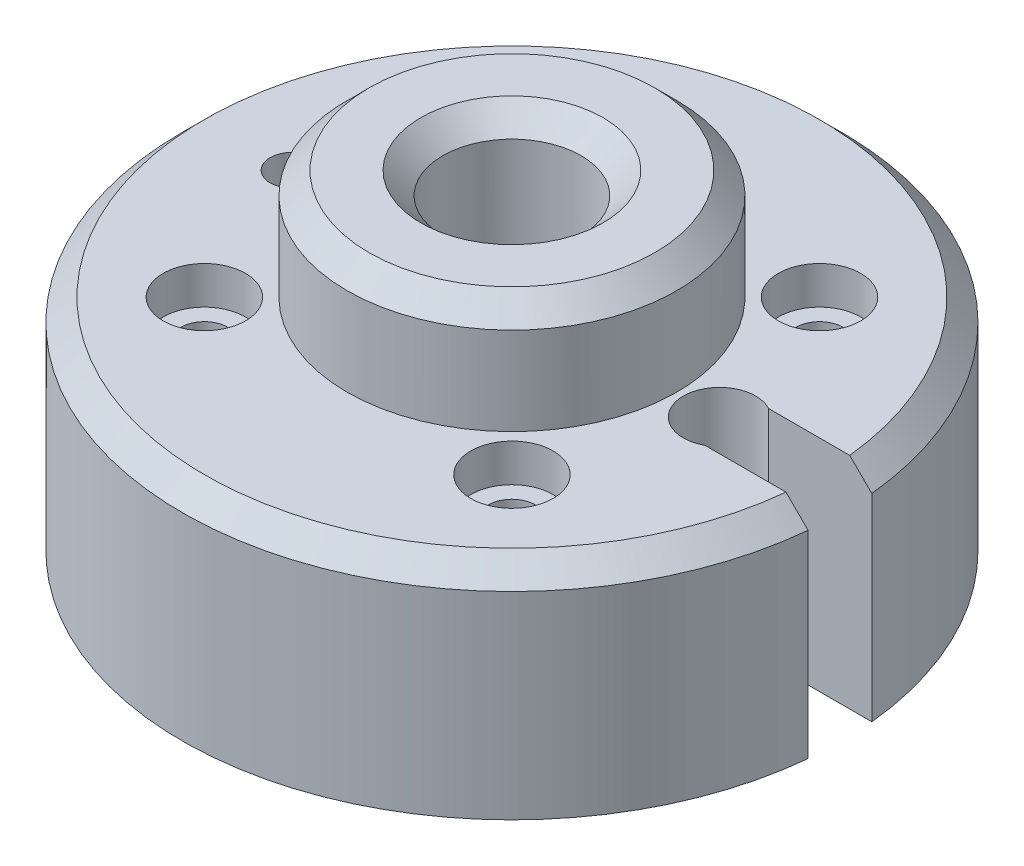
ISO-10303-21;
HEADER;
FILE_DESCRIPTION(('STEP AP214'),'2;1');
FILE_NAME('part.step','',(''),(''),'','','');
FILE_SCHEMA(('AUTOMOTIVE_DESIGN { 1 0 10303 214 1 1 1 1 }'));
ENDSEC;
DATA;
#1=APPLICATION_CONTEXT('core data for automotive mechanical design processes');
#2=APPLICATION_PROTOCOL_DEFINITION('international standard','automotive_design',2000,#1);
#3=PRODUCT_CONTEXT('',#1,'mechanical');
#4=PRODUCT('Part','Part','',(#3));
#5=PRODUCT_RELATED_PRODUCT_CATEGORY('part','',(#4));
#6=PRODUCT_DEFINITION_FORMATION('','',#4);
#7=PRODUCT_DEFINITION_CONTEXT('part definition',#1,'design');
#8=PRODUCT_DEFINITION('design','',#6,#7);
#9=PRODUCT_DEFINITION_SHAPE('','',#8);
#10=(LENGTH_UNIT() NAMED_UNIT(*) SI_UNIT(.MILLI.,.METRE.));
#11=(NAMED_UNIT(*) PLANE_ANGLE_UNIT() SI_UNIT($,.RADIAN.));
#12=(NAMED_UNIT(*) SI_UNIT($,.STERADIAN.) SOLID_ANGLE_UNIT());
#13=UNCERTAINTY_MEASURE_WITH_UNIT(LENGTH_MEASURE(1.E-05),#10,'distance_accuracy_value','');
#14=(GEOMETRIC_REPRESENTATION_CONTEXT(3) GLOBAL_UNCERTAINTY_ASSIGNED_CONTEXT((#13)) GLOBAL_UNIT_ASSIGNED_CONTEXT((#10,
#11,#12)) REPRESENTATION_CONTEXT('',''));
#15=CARTESIAN_POINT('',(0.,0.,0.));
#16=DIRECTION('',(0.,0.,1.));
#17=DIRECTION('',(1.,0.,0.));
#18=AXIS2_PLACEMENT_3D('',#15,#16,#17);
#19=CARTESIAN_POINT('',(9.525,12.7,0.));
#20=DIRECTION('',(0.,-1.,0.));
#21=DIRECTION('',(0.,0.,-1.));
#22=AXIS2_PLACEMENT_3D('',#19,#20,#21);
#23=PLANE('',#22);
#24=CARTESIAN_POINT('',(-12.7,12.7,0.));
#25=DIRECTION('',(0.,1.,0.));
#26=DIRECTION('',(0.,0.,1.));
#27=AXIS2_PLACEMENT_3D('',#24,#25,#26);
#28=CIRCLE('',#27,1.27);
#29=CARTESIAN_POINT('',(-12.7,12.7,1.27000000000001));
#30=VERTEX_POINT('',#29);
#31=EDGE_CURVE('E118',#30,#30,#28,.T.);
#32=ORIENTED_EDGE('',*,*,#31,.F.);
#33=EDGE_LOOP('',(#32));
#34=FACE_BOUND('',#33,.T.);
#35=CARTESIAN_POINT('',(12.,12.7,0.));
#36=DIRECTION('',(0.,1.,0.));
#37=DIRECTION('',(0.,0.,1.));
#38=AXIS2_PLACEMENT_3D('',#35,#36,#37);
#39=CIRCLE('',#38,2.0955);
#40=CARTESIAN_POINT('',(12.9999989999995,12.7,-1.8415));
#41=VERTEX_POINT('',#40);
#42=CARTESIAN_POINT('',(12.9999989999995,12.7,1.8415));
#43=VERTEX_POINT('',#42);
#44=EDGE_CURVE('E100',#41,#43,#39,.T.);
#45=ORIENTED_EDGE('',*,*,#44,.F.);
#46=DIRECTION('',(-1.,0.,0.));
#47=VECTOR('',#46,1.);
#48=CARTESIAN_POINT('',(12.9999989999995,12.7,-1.8415));
#49=LINE('',#48,#47);
#50=CARTESIAN_POINT('',(17.684379484449,12.7,-1.8415));
#51=VERTEX_POINT('',#50);
#52=EDGE_CURVE('E114',#51,#41,#49,.T.);
#53=ORIENTED_EDGE('',*,*,#52,.F.);
#54=CARTESIAN_POINT('',(0.,12.7,0.));
#55=DIRECTION('',(0.,-1.,0.));
#56=DIRECTION('',(0.,0.,-1.));
#57=AXIS2_PLACEMENT_3D('',#54,#55,#56);
#58=CIRCLE('',#57,17.78);
#59=CARTESIAN_POINT('',(17.684379484449,12.7,1.8415));
#60=VERTEX_POINT('',#59);
#61=EDGE_CURVE('E197',#51,#60,#58,.F.);
#62=ORIENTED_EDGE('',*,*,#61,.T.);
#63=DIRECTION('',(1.,0.,0.));
#64=VECTOR('',#63,1.);
#65=CARTESIAN_POINT('',(12.9999989999995,12.7,1.8415));
#66=LINE('',#65,#64);
#67=EDGE_CURVE('E61',#43,#60,#66,.T.);
#68=ORIENTED_EDGE('',*,*,#67,.F.);
#69=EDGE_LOOP('',(#45,#53,#62,#68));
#70=FACE_BOUND('',#69,.T.);
#71=CARTESIAN_POINT('',(0.,12.7,0.));
#72=DIRECTION('',(0.,1.,0.));
#73=DIRECTION('',(0.,0.,1.));
#74=AXIS2_PLACEMENT_3D('',#71,#72,#73);
#75=CIRCLE('',#74,9.525);
#76=CARTESIAN_POINT('',(0.,12.7,9.525));
#77=VERTEX_POINT('',#76);
#78=EDGE_CURVE('E182',#77,#77,#75,.T.);
#79=ORIENTED_EDGE('',*,*,#78,.F.);
#80=EDGE_LOOP('',(#79));
#81=FACE_BOUND('',#80,.T.);
#82=CARTESIAN_POINT('',(-8.89,12.7,-8.89));
#83=DIRECTION('',(0.,1.,0.));
#84=DIRECTION('',(0.,0.,1.));
#85=AXIS2_PLACEMENT_3D('',#82,#83,#84);
#86=CIRCLE('',#85,2.38125);
#87=CARTESIAN_POINT('',(-8.89,12.7,-6.50875));
#88=VERTEX_POINT('',#87);
#89=EDGE_CURVE('E165',#88,#88,#86,.T.);
#90=ORIENTED_EDGE('',*,*,#89,.F.);
#91=EDGE_LOOP('',(#90));
#92=FACE_BOUND('',#91,.T.);
#93=CARTESIAN_POINT('',(8.89,12.7,-8.89));
#94=DIRECTION('',(0.,1.,0.));
#95=DIRECTION('',(0.,0.,1.));
#96=AXIS2_PLACEMENT_3D('',#93,#94,#95);
#97=CIRCLE('',#96,2.38125);
#98=CARTESIAN_POINT('',(8.89,12.7,-6.50875));
#99=VERTEX_POINT('',#98);
#100=EDGE_CURVE('E153',#99,#99,#97,.T.);
#101=ORIENTED_EDGE('',*,*,#100,.F.);
#102=EDGE_LOOP('',(#101));
#103=FACE_BOUND('',#102,.T.);
#104=CARTESIAN_POINT('',(8.89,12.7,8.89));
#105=DIRECTION('',(0.,1.,0.));
#106=DIRECTION('',(0.,0.,1.));
#107=AXIS2_PLACEMENT_3D('',#104,#105,#106);
#108=CIRCLE('',#107,2.38125);
#109=CARTESIAN_POINT('',(8.89,12.7,11.27125));
#110=VERTEX_POINT('',#109);
#111=EDGE_CURVE('E141',#110,#110,#108,.T.);
#112=ORIENTED_EDGE('',*,*,#111,.F.);
#113=EDGE_LOOP('',(#112));
#114=FACE_BOUND('',#113,.T.);
#115=CARTESIAN_POINT('',(-8.89,12.7,8.89));
#116=DIRECTION('',(0.,1.,0.));
#117=DIRECTION('',(0.,0.,1.));
#118=AXIS2_PLACEMENT_3D('',#115,#116,#117);
#119=CIRCLE('',#118,2.38125);
#120=CARTESIAN_POINT('',(-8.89,12.7,11.27125));
#121=VERTEX_POINT('',#120);
#122=EDGE_CURVE('E127',#121,#121,#119,.T.);
#123=ORIENTED_EDGE('',*,*,#122,.F.);
#124=EDGE_LOOP('',(#123));
#125=FACE_BOUND('',#124,.T.);
#126=ADVANCED_FACE('F39',(#34,#70,#81,#92,#103,#114,#125),#23,.F.);
#127=CARTESIAN_POINT('',(0.,24.6002819548872,0.));
#128=DIRECTION('',(0.,1.,0.));
#129=DIRECTION('',(0.,0.,1.));
#130=AXIS2_PLACEMENT_3D('',#127,#128,#129);
#131=CYLINDRICAL_SURFACE('',#130,4.);
#132=CARTESIAN_POINT('',(0.,17.78,0.));
#133=DIRECTION('',(0.,-1.,0.));
#134=DIRECTION('',(0.,0.,-1.));
#135=AXIS2_PLACEMENT_3D('',#132,#133,#134);
#136=CIRCLE('',#135,4.);
#137=CARTESIAN_POINT('',(0.,17.78,-4.));
#138=VERTEX_POINT('',#137);
#139=EDGE_CURVE('E185',#138,#138,#136,.F.);
#140=ORIENTED_EDGE('',*,*,#139,.T.);
#141=EDGE_LOOP('',(#140));
#142=FACE_BOUND('',#141,.T.);
#143=CARTESIAN_POINT('',(0.,0.,0.));
#144=DIRECTION('',(0.,1.,0.));
#145=DIRECTION('',(0.,0.,1.));
#146=AXIS2_PLACEMENT_3D('',#143,#144,#145);
#147=CIRCLE('',#146,4.);
#148=CARTESIAN_POINT('',(0.,0.,4.));
#149=VERTEX_POINT('',#148);
#150=EDGE_CURVE('E177',#149,#149,#147,.T.);
#151=ORIENTED_EDGE('',*,*,#150,.F.);
#152=EDGE_LOOP('',(#151));
#153=FACE_BOUND('',#152,.T.);
#154=ADVANCED_FACE('F275',(#142,#153),#131,.F.);
#155=CARTESIAN_POINT('',(4.,19.05,0.));
#156=DIRECTION('',(0.,-1.,0.));
#157=DIRECTION('',(0.,0.,-1.));
#158=AXIS2_PLACEMENT_3D('',#155,#156,#157);
#159=PLANE('',#158);
#160=CARTESIAN_POINT('',(0.,19.05,0.));
#161=DIRECTION('',(0.,-1.,0.));
#162=DIRECTION('',(0.,0.,-1.));
#163=AXIS2_PLACEMENT_3D('',#160,#161,#162);
#164=CIRCLE('',#163,5.27000000000001);
#165=CARTESIAN_POINT('',(0.,19.05,-5.27000000000001));
#166=VERTEX_POINT('',#165);
#167=EDGE_CURVE('E191',#166,#166,#164,.T.);
#168=ORIENTED_EDGE('',*,*,#167,.T.);
#169=EDGE_LOOP('',(#168));
#170=FACE_BOUND('',#169,.T.);
#171=CARTESIAN_POINT('',(0.,19.05,0.));
#172=DIRECTION('',(0.,-1.,0.));
#173=DIRECTION('',(0.,0.,-1.));
#174=AXIS2_PLACEMENT_3D('',#171,#172,#173);
#175=CIRCLE('',#174,8.255);
#176=CARTESIAN_POINT('',(0.,19.05,-8.255));
#177=VERTEX_POINT('',#176);
#178=EDGE_CURVE('E188',#177,#177,#175,.F.);
#179=ORIENTED_EDGE('',*,*,#178,.T.);
#180=EDGE_LOOP('',(#179));
#181=FACE_BOUND('',#180,.T.);
#182=ADVANCED_FACE('F279',(#170,#181),#159,.F.);
#183=CARTESIAN_POINT('',(0.,24.6002819548872,0.));
#184=DIRECTION('',(0.,1.,0.));
#185=DIRECTION('',(0.,0.,1.));
#186=AXIS2_PLACEMENT_3D('',#183,#184,#185);
#187=CYLINDRICAL_SURFACE('',#186,9.525);
#188=CARTESIAN_POINT('',(0.,17.78,0.));
#189=DIRECTION('',(0.,-1.,0.));
#190=DIRECTION('',(0.,0.,-1.));
#191=AXIS2_PLACEMENT_3D('',#188,#189,#190);
#192=CIRCLE('',#191,9.525);
#193=CARTESIAN_POINT('',(0.,17.78,-9.525));
#194=VERTEX_POINT('',#193);
#195=EDGE_CURVE('E194',#194,#194,#192,.T.);
#196=ORIENTED_EDGE('',*,*,#195,.T.);
#197=EDGE_LOOP('',(#196));
#198=FACE_BOUND('',#197,.T.);
#199=ORIENTED_EDGE('',*,*,#78,.T.);
#200=EDGE_LOOP('',(#199));
#201=FACE_BOUND('',#200,.T.);
#202=ADVANCED_FACE('F271',(#198,#201),#187,.T.);
#203=CARTESIAN_POINT('',(0.,24.6002819548872,0.));
#204=DIRECTION('',(0.,1.,0.));
#205=DIRECTION('',(0.,0.,1.));
#206=AXIS2_PLACEMENT_3D('',#203,#204,#205);
#207=CYLINDRICAL_SURFACE('',#206,19.05);
#208=CARTESIAN_POINT('',(0.,11.43,0.));
#209=DIRECTION('',(0.,-1.,0.));
#210=DIRECTION('',(0.,0.,-1.));
#211=AXIS2_PLACEMENT_3D('',#208,#209,#210);
#212=CIRCLE('',#211,19.05);
#213=CARTESIAN_POINT('',(18.9607852619558,11.43,1.8415));
#214=VERTEX_POINT('',#213);
#215=CARTESIAN_POINT('',(18.9607852619558,11.43,-1.8415));
#216=VERTEX_POINT('',#215);
#217=EDGE_CURVE('E200',#214,#216,#212,.T.);
#218=ORIENTED_EDGE('',*,*,#217,.T.);
#219=DIRECTION('',(0.,1.,0.));
#220=VECTOR('',#219,1.);
#221=CARTESIAN_POINT('',(18.9607852619558,0.,-1.8415));
#222=LINE('',#221,#220);
#223=CARTESIAN_POINT('',(18.9607852619558,0.,-1.8415));
#224=VERTEX_POINT('',#223);
#225=EDGE_CURVE('E68',#224,#216,#222,.T.);
#226=ORIENTED_EDGE('',*,*,#225,.F.);
#227=CARTESIAN_POINT('',(0.,0.,0.));
#228=DIRECTION('',(0.,1.,0.));
#229=DIRECTION('',(0.,0.,1.));
#230=AXIS2_PLACEMENT_3D('',#227,#228,#229);
#231=CIRCLE('',#230,19.05);
#232=CARTESIAN_POINT('',(18.9607852619558,0.,1.8415));
#233=VERTEX_POINT('',#232);
#234=EDGE_CURVE('E180',#224,#233,#231,.T.);
#235=ORIENTED_EDGE('',*,*,#234,.T.);
#236=DIRECTION('',(0.,1.,0.));
#237=VECTOR('',#236,1.);
#238=CARTESIAN_POINT('',(18.9607852619558,0.,1.8415));
#239=LINE('',#238,#237);
#240=EDGE_CURVE('E101',#233,#214,#239,.T.);
#241=ORIENTED_EDGE('',*,*,#240,.T.);
#242=EDGE_LOOP('',(#218,#226,#235,#241));
#243=FACE_BOUND('',#242,.T.);
#244=ADVANCED_FACE('F267',(#243),#207,.T.);
#245=CARTESIAN_POINT('',(19.05,0.,0.));
#246=DIRECTION('',(0.,1.,0.));
#247=DIRECTION('',(0.,0.,1.));
#248=AXIS2_PLACEMENT_3D('',#245,#246,#247);
#249=PLANE('',#248);
#250=CARTESIAN_POINT('',(-12.7,0.,0.));
#251=DIRECTION('',(0.,1.,0.));
#252=DIRECTION('',(0.,0.,1.));
#253=AXIS2_PLACEMENT_3D('',#250,#251,#252);
#254=CIRCLE('',#253,1.27);
#255=CARTESIAN_POINT('',(-12.7,0.,1.27000000000001));
#256=VERTEX_POINT('',#255);
#257=EDGE_CURVE('E123',#256,#256,#254,.T.);
#258=ORIENTED_EDGE('',*,*,#257,.T.);
#259=EDGE_LOOP('',(#258));
#260=FACE_BOUND('',#259,.T.);
#261=CARTESIAN_POINT('',(-8.89,0.,8.89));
#262=DIRECTION('',(0.,1.,0.));
#263=DIRECTION('',(0.,0.,1.));
#264=AXIS2_PLACEMENT_3D('',#261,#262,#263);
#265=CIRCLE('',#264,1.35255);
#266=CARTESIAN_POINT('',(-8.89,0.,10.24255));
#267=VERTEX_POINT('',#266);
#268=EDGE_CURVE('E138',#267,#267,#265,.T.);
#269=ORIENTED_EDGE('',*,*,#268,.T.);
#270=EDGE_LOOP('',(#269));
#271=FACE_BOUND('',#270,.T.);
#272=CARTESIAN_POINT('',(8.89,0.,8.89));
#273=DIRECTION('',(0.,1.,0.));
#274=DIRECTION('',(0.,0.,1.));
#275=AXIS2_PLACEMENT_3D('',#272,#273,#274);
#276=CIRCLE('',#275,1.35255);
#277=CARTESIAN_POINT('',(8.89,0.,10.24255));
#278=VERTEX_POINT('',#277);
#279=EDGE_CURVE('E150',#278,#278,#276,.T.);
#280=ORIENTED_EDGE('',*,*,#279,.T.);
#281=EDGE_LOOP('',(#280));
#282=FACE_BOUND('',#281,.T.);
#283=CARTESIAN_POINT('',(8.89,0.,-8.89));
#284=DIRECTION('',(0.,1.,0.));
#285=DIRECTION('',(0.,0.,1.));
#286=AXIS2_PLACEMENT_3D('',#283,#284,#285);
#287=CIRCLE('',#286,1.35255);
#288=CARTESIAN_POINT('',(8.89,0.,-7.53745));
#289=VERTEX_POINT('',#288);
#290=EDGE_CURVE('E162',#289,#289,#287,.T.);
#291=ORIENTED_EDGE('',*,*,#290,.T.);
#292=EDGE_LOOP('',(#291));
#293=FACE_BOUND('',#292,.T.);
#294=CARTESIAN_POINT('',(-8.89,0.,-8.89));
#295=DIRECTION('',(0.,1.,0.));
#296=DIRECTION('',(0.,0.,1.));
#297=AXIS2_PLACEMENT_3D('',#294,#295,#296);
#298=CIRCLE('',#297,1.35255);
#299=CARTESIAN_POINT('',(-8.89,0.,-7.53745));
#300=VERTEX_POINT('',#299);
#301=EDGE_CURVE('E174',#300,#300,#298,.T.);
#302=ORIENTED_EDGE('',*,*,#301,.T.);
#303=EDGE_LOOP('',(#302));
#304=FACE_BOUND('',#303,.T.);
#305=ORIENTED_EDGE('',*,*,#234,.F.);
#306=DIRECTION('',(-1.,0.,0.));
#307=VECTOR('',#306,1.);
#308=CARTESIAN_POINT('',(12.9999989999995,0.,-1.8415));
#309=LINE('',#308,#307);
#310=CARTESIAN_POINT('',(12.9999989999995,0.,-1.8415));
#311=VERTEX_POINT('',#310);
#312=EDGE_CURVE('E102',#224,#311,#309,.T.);
#313=ORIENTED_EDGE('',*,*,#312,.T.);
#314=CARTESIAN_POINT('',(12.,0.,0.));
#315=DIRECTION('',(0.,1.,0.));
#316=DIRECTION('',(0.,0.,1.));
#317=AXIS2_PLACEMENT_3D('',#314,#315,#316);
#318=CIRCLE('',#317,2.0955);
#319=CARTESIAN_POINT('',(12.9999989999995,0.,1.8415));
#320=VERTEX_POINT('',#319);
#321=EDGE_CURVE('E97',#311,#320,#318,.T.);
#322=ORIENTED_EDGE('',*,*,#321,.T.);
#323=DIRECTION('',(1.,0.,0.));
#324=VECTOR('',#323,1.);
#325=CARTESIAN_POINT('',(12.9999989999995,0.,1.8415));
#326=LINE('',#325,#324);
#327=EDGE_CURVE('E105',#320,#233,#326,.T.);
#328=ORIENTED_EDGE('',*,*,#327,.T.);
#329=EDGE_LOOP('',(#305,#313,#322,#328));
#330=FACE_BOUND('',#329,.T.);
#331=ORIENTED_EDGE('',*,*,#150,.T.);
#332=EDGE_LOOP('',(#331));
#333=FACE_BOUND('',#332,.T.);
#334=ADVANCED_FACE('F112',(#260,#271,#282,#293,#304,#330,#333),#249,.F.);
#335=CARTESIAN_POINT('',(0.,17.78,0.));
#336=DIRECTION('',(0.,1.,0.));
#337=DIRECTION('',(0.,0.,1.));
#338=AXIS2_PLACEMENT_3D('',#335,#336,#337);
#339=CONICAL_SURFACE('',#338,4.,0.785398163397448);
#340=ORIENTED_EDGE('',*,*,#167,.F.);
#341=EDGE_LOOP('',(#340));
#342=FACE_BOUND('',#341,.T.);
#343=ORIENTED_EDGE('',*,*,#139,.F.);
#344=EDGE_LOOP('',(#343));
#345=FACE_BOUND('',#344,.T.);
#346=ADVANCED_FACE('F266',(#342,#345),#339,.F.);
#347=CARTESIAN_POINT('',(0.,19.05,0.));
#348=DIRECTION('',(0.,-1.,0.));
#349=DIRECTION('',(0.,0.,-1.));
#350=AXIS2_PLACEMENT_3D('',#347,#348,#349);
#351=CONICAL_SURFACE('',#350,8.255,0.785398163397447);
#352=ORIENTED_EDGE('',*,*,#195,.F.);
#353=EDGE_LOOP('',(#352));
#354=FACE_BOUND('',#353,.T.);
#355=ORIENTED_EDGE('',*,*,#178,.F.);
#356=EDGE_LOOP('',(#355));
#357=FACE_BOUND('',#356,.T.);
#358=ADVANCED_FACE('F292',(#354,#357),#351,.T.);
#359=CARTESIAN_POINT('',(0.,12.7,0.));
#360=DIRECTION('',(0.,-1.,0.));
#361=DIRECTION('',(0.,0.,-1.));
#362=AXIS2_PLACEMENT_3D('',#359,#360,#361);
#363=CONICAL_SURFACE('',#362,17.78,0.785398163397447);
#364=CARTESIAN_POINT('',(25.0555625943659,5.35685650301324,-1.8415));
#365=CARTESIAN_POINT('',(24.4932561736051,5.91764950044653,-1.8415));
#366=CARTESIAN_POINT('',(23.9309002310919,6.4783928312726,-1.8415));
#367=CARTESIAN_POINT('',(22.8060627346984,7.59975357625896,-1.8415));
#368=CARTESIAN_POINT('',(22.2435811808086,8.16037099040961,-1.8415));
#369=CARTESIAN_POINT('',(20.5559097390915,9.84199299908757,-1.8415));
#370=CARTESIAN_POINT('',(19.4304917123323,10.962768715324,-1.8415));
#371=CARTESIAN_POINT('',(17.7416042920459,12.6431695483903,-1.8415));
#372=CARTESIAN_POINT('',(17.1785147313153,13.203176390704,-1.8415));
#373=CARTESIAN_POINT('',(16.0519913538882,14.322843533949,-1.8415));
#374=CARTESIAN_POINT('',(15.4885575372516,14.8825038349406,-1.8415));
#375=CARTESIAN_POINT('',(14.3612258908349,16.0013584539838,-1.8415));
#376=CARTESIAN_POINT('',(13.7973280604925,16.5605527714689,-1.8415));
#377=CARTESIAN_POINT('',(12.668842054445,17.678244981016,-1.8415));
#378=CARTESIAN_POINT('',(12.1042538783234,18.2367428726573,-1.8415));
#379=CARTESIAN_POINT('',(11.53920736191,18.7947773324101,-1.8415));
#380=B_SPLINE_CURVE_WITH_KNOTS('',3,(#364,#365,#366,#367,#368,#369,#370,#371,#372,#373,#374,
#375,#376,#377,#378,#379),.UNSPECIFIED.,.F.,.F.,(4,2,2,2,2,2,2,4),(0.,2.38245578344614,
4.76491174934632,9.5298179231002,11.9122740312497,14.2947297247369,16.6771883095794,
19.0596483325356),.UNSPECIFIED.);
#381=EDGE_CURVE('E11',#216,#51,#380,.T.);
#382=ORIENTED_EDGE('',*,*,#381,.F.);
#383=ORIENTED_EDGE('',*,*,#217,.F.);
#384=CARTESIAN_POINT('',(11.53920736191,18.7947773324101,1.8415));
#385=CARTESIAN_POINT('',(11.9450792285909,18.3939634796539,1.8415));
#386=CARTESIAN_POINT('',(12.3507029013534,17.9928985487092,1.8415));
#387=CARTESIAN_POINT('',(13.1615560966799,17.1903707008117,1.8415));
#388=CARTESIAN_POINT('',(13.5667856193834,16.7889077839997,1.8415));
#389=CARTESIAN_POINT('',(14.782036063307,15.5840785645008,1.8415));
#390=CARTESIAN_POINT('',(15.591619547444,14.7802711135149,1.8415));
#391=CARTESIAN_POINT('',(17.2100621068934,13.171929683684,1.8415));
#392=CARTESIAN_POINT('',(18.0189211831637,12.3673957058025,1.8415));
#393=CARTESIAN_POINT('',(19.6361555113898,10.757841312615,1.8415));
#394=CARTESIAN_POINT('',(20.4445307632417,9.95282089720472,1.8415));
#395=CARTESIAN_POINT('',(21.8867199846455,8.516014752828,1.8415));
#396=CARTESIAN_POINT('',(22.5205988740324,7.88429417781707,1.8415));
#397=CARTESIAN_POINT('',(23.788192807433,6.62068805234563,1.8415));
#398=CARTESIAN_POINT('',(24.4219078513678,5.98880250180596,1.8415));
#399=CARTESIAN_POINT('',(25.0555625943659,5.35685650301324,1.8415));
#400=B_SPLINE_CURVE_WITH_KNOTS('',3,(#384,#385,#386,#387,#388,#389,#390,#391,#392,#393,#394,
#395,#396,#397,#398,#399),.UNSPECIFIED.,.F.,.F.,(4,2,2,2,2,2,2,4),(0.,1.71127210234614,
3.42254359897174,6.84508369373437,10.2676192561357,13.6901555529842,16.3749013201057,
19.0596483775198),.UNSPECIFIED.);
#401=EDGE_CURVE('E54',#60,#214,#400,.T.);
#402=ORIENTED_EDGE('',*,*,#401,.F.);
#403=ORIENTED_EDGE('',*,*,#61,.F.);
#404=EDGE_LOOP('',(#382,#383,#402,#403));
#405=FACE_BOUND('',#404,.T.);
#406=ADVANCED_FACE('F42',(#405),#363,.T.);
#407=CARTESIAN_POINT('',(-8.89,12.7,-8.89));
#408=DIRECTION('',(0.,1.,0.));
#409=DIRECTION('',(0.,0.,1.));
#410=AXIS2_PLACEMENT_3D('',#407,#408,#409);
#411=CYLINDRICAL_SURFACE('',#410,1.35255);
#412=ORIENTED_EDGE('',*,*,#301,.F.);
#413=EDGE_LOOP('',(#412));
#414=FACE_BOUND('',#413,.T.);
#415=CARTESIAN_POINT('',(-8.89,10.5156,-8.89));
#416=DIRECTION('',(0.,1.,0.));
#417=DIRECTION('',(0.,0.,1.));
#418=AXIS2_PLACEMENT_3D('',#415,#416,#417);
#419=CIRCLE('',#418,1.35255);
#420=CARTESIAN_POINT('',(-8.89,10.5156,-7.53745));
#421=VERTEX_POINT('',#420);
#422=EDGE_CURVE('E171',#421,#421,#419,.T.);
#423=ORIENTED_EDGE('',*,*,#422,.T.);
#424=EDGE_LOOP('',(#423));
#425=FACE_BOUND('',#424,.T.);
#426=ADVANCED_FACE('F259',(#414,#425),#411,.F.);
#427=CARTESIAN_POINT('',(-7.53745,10.5156,-8.89));
#428=DIRECTION('',(0.,-1.,0.));
#429=DIRECTION('',(0.,0.,-1.));
#430=AXIS2_PLACEMENT_3D('',#427,#428,#429);
#431=PLANE('',#430);
#432=ORIENTED_EDGE('',*,*,#422,.F.);
#433=EDGE_LOOP('',(#432));
#434=FACE_BOUND('',#433,.T.);
#435=CARTESIAN_POINT('',(-8.89,10.5156,-8.89));
#436=DIRECTION('',(0.,1.,0.));
#437=DIRECTION('',(0.,0.,1.));
#438=AXIS2_PLACEMENT_3D('',#435,#436,#437);
#439=CIRCLE('',#438,2.38125);
#440=CARTESIAN_POINT('',(-8.89,10.5156,-6.50875));
#441=VERTEX_POINT('',#440);
#442=EDGE_CURVE('E168',#441,#441,#439,.T.);
#443=ORIENTED_EDGE('',*,*,#442,.T.);
#444=EDGE_LOOP('',(#443));
#445=FACE_BOUND('',#444,.T.);
#446=ADVANCED_FACE('F255',(#434,#445),#431,.F.);
#447=CARTESIAN_POINT('',(-8.89,12.7,-8.89));
#448=DIRECTION('',(0.,1.,0.));
#449=DIRECTION('',(0.,0.,1.));
#450=AXIS2_PLACEMENT_3D('',#447,#448,#449);
#451=CYLINDRICAL_SURFACE('',#450,2.38125);
#452=ORIENTED_EDGE('',*,*,#442,.F.);
#453=EDGE_LOOP('',(#452));
#454=FACE_BOUND('',#453,.T.);
#455=ORIENTED_EDGE('',*,*,#89,.T.);
#456=EDGE_LOOP('',(#455));
#457=FACE_BOUND('',#456,.T.);
#458=ADVANCED_FACE('F251',(#454,#457),#451,.F.);
#459=CARTESIAN_POINT('',(8.89,12.7,-8.89));
#460=DIRECTION('',(0.,1.,0.));
#461=DIRECTION('',(0.,0.,1.));
#462=AXIS2_PLACEMENT_3D('',#459,#460,#461);
#463=CYLINDRICAL_SURFACE('',#462,1.35255);
#464=ORIENTED_EDGE('',*,*,#290,.F.);
#465=EDGE_LOOP('',(#464));
#466=FACE_BOUND('',#465,.T.);
#467=CARTESIAN_POINT('',(8.89,10.5156,-8.89));
#468=DIRECTION('',(0.,1.,0.));
#469=DIRECTION('',(0.,0.,1.));
#470=AXIS2_PLACEMENT_3D('',#467,#468,#469);
#471=CIRCLE('',#470,1.35255);
#472=CARTESIAN_POINT('',(8.89,10.5156,-7.53745));
#473=VERTEX_POINT('',#472);
#474=EDGE_CURVE('E159',#473,#473,#471,.T.);
#475=ORIENTED_EDGE('',*,*,#474,.T.);
#476=EDGE_LOOP('',(#475));
#477=FACE_BOUND('',#476,.T.);
#478=ADVANCED_FACE('F247',(#466,#477),#463,.F.);
#479=CARTESIAN_POINT('',(10.24255,10.5156,-8.89));
#480=DIRECTION('',(0.,-1.,0.));
#481=DIRECTION('',(0.,0.,-1.));
#482=AXIS2_PLACEMENT_3D('',#479,#480,#481);
#483=PLANE('',#482);
#484=ORIENTED_EDGE('',*,*,#474,.F.);
#485=EDGE_LOOP('',(#484));
#486=FACE_BOUND('',#485,.T.);
#487=CARTESIAN_POINT('',(8.89,10.5156,-8.89));
#488=DIRECTION('',(0.,1.,0.));
#489=DIRECTION('',(0.,0.,1.));
#490=AXIS2_PLACEMENT_3D('',#487,#488,#489);
#491=CIRCLE('',#490,2.38125);
#492=CARTESIAN_POINT('',(8.89,10.5156,-6.50875));
#493=VERTEX_POINT('',#492);
#494=EDGE_CURVE('E156',#493,#493,#491,.T.);
#495=ORIENTED_EDGE('',*,*,#494,.T.);
#496=EDGE_LOOP('',(#495));
#497=FACE_BOUND('',#496,.T.);
#498=ADVANCED_FACE('F243',(#486,#497),#483,.F.);
#499=CARTESIAN_POINT('',(8.89,12.7,-8.89));
#500=DIRECTION('',(0.,1.,0.));
#501=DIRECTION('',(0.,0.,1.));
#502=AXIS2_PLACEMENT_3D('',#499,#500,#501);
#503=CYLINDRICAL_SURFACE('',#502,2.38125);
#504=ORIENTED_EDGE('',*,*,#494,.F.);
#505=EDGE_LOOP('',(#504));
#506=FACE_BOUND('',#505,.T.);
#507=ORIENTED_EDGE('',*,*,#100,.T.);
#508=EDGE_LOOP('',(#507));
#509=FACE_BOUND('',#508,.T.);
#510=ADVANCED_FACE('F239',(#506,#509),#503,.F.);
#511=CARTESIAN_POINT('',(8.89,12.7,8.89));
#512=DIRECTION('',(0.,1.,0.));
#513=DIRECTION('',(0.,0.,1.));
#514=AXIS2_PLACEMENT_3D('',#511,#512,#513);
#515=CYLINDRICAL_SURFACE('',#514,1.35255);
#516=ORIENTED_EDGE('',*,*,#279,.F.);
#517=EDGE_LOOP('',(#516));
#518=FACE_BOUND('',#517,.T.);
#519=CARTESIAN_POINT('',(8.89,10.5156,8.89));
#520=DIRECTION('',(0.,1.,0.));
#521=DIRECTION('',(0.,0.,1.));
#522=AXIS2_PLACEMENT_3D('',#519,#520,#521);
#523=CIRCLE('',#522,1.35255);
#524=CARTESIAN_POINT('',(8.89,10.5156,10.24255));
#525=VERTEX_POINT('',#524);
#526=EDGE_CURVE('E147',#525,#525,#523,.T.);
#527=ORIENTED_EDGE('',*,*,#526,.T.);
#528=EDGE_LOOP('',(#527));
#529=FACE_BOUND('',#528,.T.);
#530=ADVANCED_FACE('F235',(#518,#529),#515,.F.);
#531=CARTESIAN_POINT('',(10.24255,10.5156,8.89));
#532=DIRECTION('',(0.,-1.,0.));
#533=DIRECTION('',(0.,0.,-1.));
#534=AXIS2_PLACEMENT_3D('',#531,#532,#533);
#535=PLANE('',#534);
#536=ORIENTED_EDGE('',*,*,#526,.F.);
#537=EDGE_LOOP('',(#536));
#538=FACE_BOUND('',#537,.T.);
#539=CARTESIAN_POINT('',(8.89,10.5156,8.89));
#540=DIRECTION('',(0.,1.,0.));
#541=DIRECTION('',(0.,0.,1.));
#542=AXIS2_PLACEMENT_3D('',#539,#540,#541);
#543=CIRCLE('',#542,2.38125);
#544=CARTESIAN_POINT('',(8.89,10.5156,11.27125));
#545=VERTEX_POINT('',#544);
#546=EDGE_CURVE('E144',#545,#545,#543,.T.);
#547=ORIENTED_EDGE('',*,*,#546,.T.);
#548=EDGE_LOOP('',(#547));
#549=FACE_BOUND('',#548,.T.);
#550=ADVANCED_FACE('F231',(#538,#549),#535,.F.);
#551=CARTESIAN_POINT('',(8.89,12.7,8.89));
#552=DIRECTION('',(0.,1.,0.));
#553=DIRECTION('',(0.,0.,1.));
#554=AXIS2_PLACEMENT_3D('',#551,#552,#553);
#555=CYLINDRICAL_SURFACE('',#554,2.38125);
#556=ORIENTED_EDGE('',*,*,#546,.F.);
#557=EDGE_LOOP('',(#556));
#558=FACE_BOUND('',#557,.T.);
#559=ORIENTED_EDGE('',*,*,#111,.T.);
#560=EDGE_LOOP('',(#559));
#561=FACE_BOUND('',#560,.T.);
#562=ADVANCED_FACE('F227',(#558,#561),#555,.F.);
#563=CARTESIAN_POINT('',(-8.89,12.7,8.89));
#564=DIRECTION('',(0.,1.,0.));
#565=DIRECTION('',(0.,0.,1.));
#566=AXIS2_PLACEMENT_3D('',#563,#564,#565);
#567=CYLINDRICAL_SURFACE('',#566,1.35255);
#568=ORIENTED_EDGE('',*,*,#268,.F.);
#569=EDGE_LOOP('',(#568));
#570=FACE_BOUND('',#569,.T.);
#571=CARTESIAN_POINT('',(-8.89,10.5156,8.89));
#572=DIRECTION('',(0.,1.,0.));
#573=DIRECTION('',(0.,0.,1.));
#574=AXIS2_PLACEMENT_3D('',#571,#572,#573);
#575=CIRCLE('',#574,1.35255);
#576=CARTESIAN_POINT('',(-8.89,10.5156,10.24255));
#577=VERTEX_POINT('',#576);
#578=EDGE_CURVE('E135',#577,#577,#575,.T.);
#579=ORIENTED_EDGE('',*,*,#578,.T.);
#580=EDGE_LOOP('',(#579));
#581=FACE_BOUND('',#580,.T.);
#582=ADVANCED_FACE('F223',(#570,#581),#567,.F.);
#583=CARTESIAN_POINT('',(-7.53745,10.5156,8.89));
#584=DIRECTION('',(0.,-1.,0.));
#585=DIRECTION('',(0.,0.,-1.));
#586=AXIS2_PLACEMENT_3D('',#583,#584,#585);
#587=PLANE('',#586);
#588=ORIENTED_EDGE('',*,*,#578,.F.);
#589=EDGE_LOOP('',(#588));
#590=FACE_BOUND('',#589,.T.);
#591=CARTESIAN_POINT('',(-8.89,10.5156,8.89));
#592=DIRECTION('',(0.,1.,0.));
#593=DIRECTION('',(0.,0.,1.));
#594=AXIS2_PLACEMENT_3D('',#591,#592,#593);
#595=CIRCLE('',#594,2.38125);
#596=CARTESIAN_POINT('',(-8.89,10.5156,11.27125));
#597=VERTEX_POINT('',#596);
#598=EDGE_CURVE('E132',#597,#597,#595,.T.);
#599=ORIENTED_EDGE('',*,*,#598,.T.);
#600=EDGE_LOOP('',(#599));
#601=FACE_BOUND('',#600,.T.);
#602=ADVANCED_FACE('F219',(#590,#601),#587,.F.);
#603=CARTESIAN_POINT('',(-8.89,12.7,8.89));
#604=DIRECTION('',(0.,1.,0.));
#605=DIRECTION('',(0.,0.,1.));
#606=AXIS2_PLACEMENT_3D('',#603,#604,#605);
#607=CYLINDRICAL_SURFACE('',#606,2.38125);
#608=ORIENTED_EDGE('',*,*,#598,.F.);
#609=EDGE_LOOP('',(#608));
#610=FACE_BOUND('',#609,.T.);
#611=ORIENTED_EDGE('',*,*,#122,.T.);
#612=EDGE_LOOP('',(#611));
#613=FACE_BOUND('',#612,.T.);
#614=ADVANCED_FACE('F216',(#610,#613),#607,.F.);
#615=CARTESIAN_POINT('',(12.,0.,0.));
#616=DIRECTION('',(0.,1.,0.));
#617=DIRECTION('',(0.,0.,1.));
#618=AXIS2_PLACEMENT_3D('',#615,#616,#617);
#619=CYLINDRICAL_SURFACE('',#618,2.0955);
#620=ORIENTED_EDGE('',*,*,#44,.T.);
#621=DIRECTION('',(0.,1.,0.));
#622=VECTOR('',#621,1.);
#623=CARTESIAN_POINT('',(12.9999989999995,0.,1.8415));
#624=LINE('',#623,#622);
#625=EDGE_CURVE('E92',#320,#43,#624,.T.);
#626=ORIENTED_EDGE('',*,*,#625,.F.);
#627=ORIENTED_EDGE('',*,*,#321,.F.);
#628=DIRECTION('',(0.,1.,0.));
#629=VECTOR('',#628,1.);
#630=CARTESIAN_POINT('',(12.9999989999995,0.,-1.8415));
#631=LINE('',#630,#629);
#632=EDGE_CURVE('E125',#311,#41,#631,.T.);
#633=ORIENTED_EDGE('',*,*,#632,.T.);
#634=EDGE_LOOP('',(#620,#626,#627,#633));
#635=FACE_BOUND('',#634,.T.);
#636=ADVANCED_FACE('F94',(#635),#619,.F.);
#637=CARTESIAN_POINT('',(12.9999989999995,0.,-1.8415));
#638=DIRECTION('',(0.,0.,-1.));
#639=DIRECTION('',(-1.,0.,0.));
#640=AXIS2_PLACEMENT_3D('',#637,#638,#639);
#641=PLANE('',#640);
#642=ORIENTED_EDGE('',*,*,#381,.T.);
#643=ORIENTED_EDGE('',*,*,#52,.T.);
#644=ORIENTED_EDGE('',*,*,#632,.F.);
#645=ORIENTED_EDGE('',*,*,#312,.F.);
#646=ORIENTED_EDGE('',*,*,#225,.T.);
#647=EDGE_LOOP('',(#642,#643,#644,#645,#646));
#648=FACE_BOUND('',#647,.T.);
#649=ADVANCED_FACE('F211',(#648),#641,.F.);
#650=CARTESIAN_POINT('',(12.9999989999995,0.,1.8415));
#651=DIRECTION('',(0.,0.,1.));
#652=DIRECTION('',(1.,0.,0.));
#653=AXIS2_PLACEMENT_3D('',#650,#651,#652);
#654=PLANE('',#653);
#655=ORIENTED_EDGE('',*,*,#401,.T.);
#656=ORIENTED_EDGE('',*,*,#240,.F.);
#657=ORIENTED_EDGE('',*,*,#327,.F.);
#658=ORIENTED_EDGE('',*,*,#625,.T.);
#659=ORIENTED_EDGE('',*,*,#67,.T.);
#660=EDGE_LOOP('',(#655,#656,#657,#658,#659));
#661=FACE_BOUND('',#660,.T.);
#662=ADVANCED_FACE('F106',(#661),#654,.F.);
#663=CARTESIAN_POINT('',(-12.7,0.,0.));
#664=DIRECTION('',(0.,1.,0.));
#665=DIRECTION('',(0.,0.,1.));
#666=AXIS2_PLACEMENT_3D('',#663,#664,#665);
#667=CYLINDRICAL_SURFACE('',#666,1.27);
#668=ORIENTED_EDGE('',*,*,#257,.F.);
#669=EDGE_LOOP('',(#668));
#670=FACE_BOUND('',#669,.T.);
#671=ORIENTED_EDGE('',*,*,#31,.T.);
#672=EDGE_LOOP('',(#671));
#673=FACE_BOUND('',#672,.T.);
#674=ADVANCED_FACE('F210',(#670,#673),#667,.F.);
#675=CLOSED_SHELL('',(#126,#154,#182,#202,#244,#334,#346,#358,#406,#426,#446,#458,#478,#498,
#510,#530,#550,#562,#582,#602,#614,#636,#649,#662,#674));
#676=MANIFOLD_SOLID_BREP('B2',#675);
#677=ADVANCED_BREP_SHAPE_REPRESENTATION('',(#18,#676),#14);
#678=SHAPE_DEFINITION_REPRESENTATION(#9,#677);
ENDSEC;
END-ISO-10303-21;
